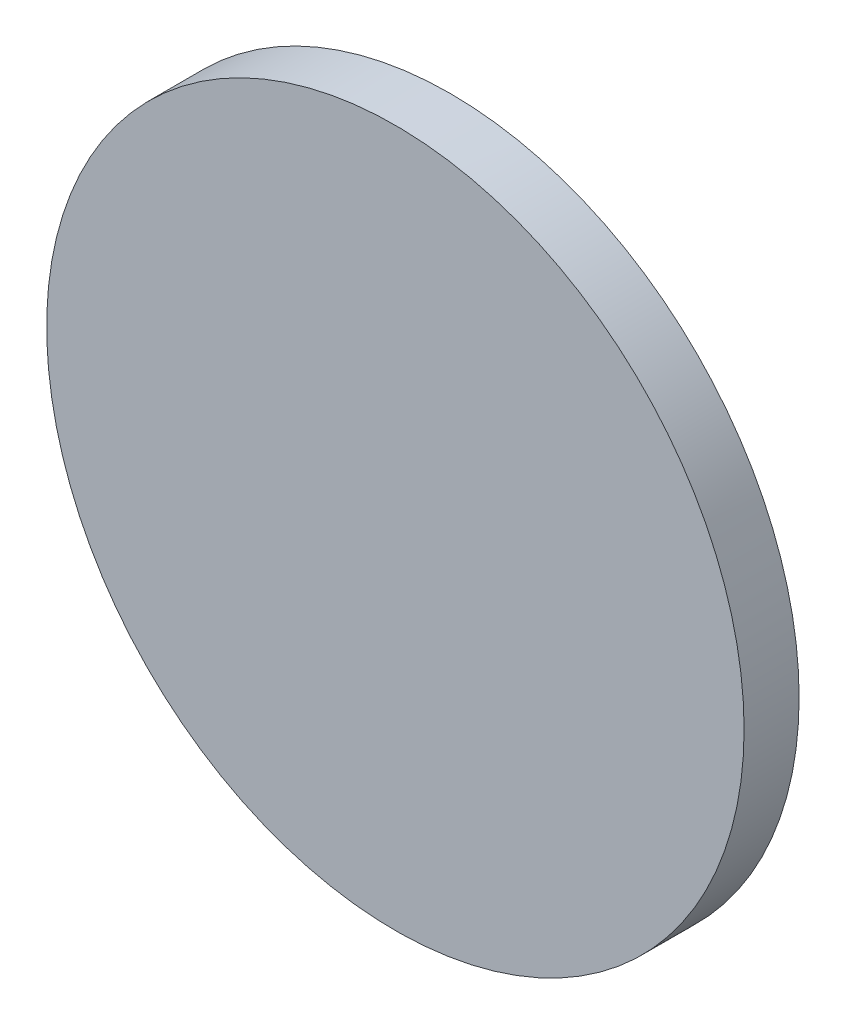
ISO-10303-21;
HEADER;
FILE_DESCRIPTION(('STEP AP214'),'2;1');
FILE_NAME('part.step','',(''),(''),'','','');
FILE_SCHEMA(('AUTOMOTIVE_DESIGN { 1 0 10303 214 1 1 1 1 }'));
ENDSEC;
DATA;
#1=APPLICATION_CONTEXT('core data for automotive mechanical design processes');
#2=APPLICATION_PROTOCOL_DEFINITION('international standard','automotive_design',2000,#1);
#3=PRODUCT_CONTEXT('',#1,'mechanical');
#4=PRODUCT('Part','Part','',(#3));
#5=PRODUCT_RELATED_PRODUCT_CATEGORY('part','',(#4));
#6=PRODUCT_DEFINITION_FORMATION('','',#4);
#7=PRODUCT_DEFINITION_CONTEXT('part definition',#1,'design');
#8=PRODUCT_DEFINITION('design','',#6,#7);
#9=PRODUCT_DEFINITION_SHAPE('','',#8);
#10=(LENGTH_UNIT() NAMED_UNIT(*) SI_UNIT(.MILLI.,.METRE.));
#11=(NAMED_UNIT(*) PLANE_ANGLE_UNIT() SI_UNIT($,.RADIAN.));
#12=(NAMED_UNIT(*) SI_UNIT($,.STERADIAN.) SOLID_ANGLE_UNIT());
#13=UNCERTAINTY_MEASURE_WITH_UNIT(LENGTH_MEASURE(1.E-05),#10,'distance_accuracy_value','');
#14=(GEOMETRIC_REPRESENTATION_CONTEXT(3) GLOBAL_UNCERTAINTY_ASSIGNED_CONTEXT((#13)) GLOBAL_UNIT_ASSIGNED_CONTEXT((#10,
#11,#12)) REPRESENTATION_CONTEXT('',''));
#15=CARTESIAN_POINT('',(0.,0.,0.));
#16=DIRECTION('',(0.,0.,1.));
#17=DIRECTION('',(1.,0.,0.));
#18=AXIS2_PLACEMENT_3D('',#15,#16,#17);
#19=CARTESIAN_POINT('',(0.,26.112,6.16));
#20=DIRECTION('',(0.,0.,1.));
#21=DIRECTION('',(1.,0.,0.));
#22=AXIS2_PLACEMENT_3D('',#19,#20,#21);
#23=PLANE('',#22);
#24=CARTESIAN_POINT('',(0.,0.,6.16));
#25=DIRECTION('',(0.,0.,1.));
#26=DIRECTION('',(1.,0.,0.));
#27=AXIS2_PLACEMENT_3D('',#24,#25,#26);
#28=CIRCLE('',#27,12.7);
#29=CARTESIAN_POINT('',(12.7,0.,6.16));
#30=VERTEX_POINT('',#29);
#31=EDGE_CURVE('E18',#30,#30,#28,.F.);
#32=ORIENTED_EDGE('',*,*,#31,.F.);
#33=EDGE_LOOP('',(#32));
#34=FACE_BOUND('',#33,.T.);
#35=ADVANCED_FACE('F15',(#34),#23,.T.);
#36=CARTESIAN_POINT('',(0.,0.,4.15666201346606));
#37=DIRECTION('',(0.,0.,1.));
#38=DIRECTION('',(1.,0.,0.));
#39=AXIS2_PLACEMENT_3D('',#36,#37,#38);
#40=CYLINDRICAL_SURFACE('',#39,12.7);
#41=ORIENTED_EDGE('',*,*,#31,.T.);
#42=EDGE_LOOP('',(#41));
#43=FACE_BOUND('',#42,.T.);
#44=CARTESIAN_POINT('',(0.,0.,4.15666201346606));
#45=DIRECTION('',(0.,0.,-1.));
#46=DIRECTION('',(-1.,0.,0.));
#47=AXIS2_PLACEMENT_3D('',#44,#45,#46);
#48=CIRCLE('',#47,12.7);
#49=CARTESIAN_POINT('',(-12.7,0.,4.15666201346606));
#50=VERTEX_POINT('',#49);
#51=EDGE_CURVE('E9',#50,#50,#48,.T.);
#52=ORIENTED_EDGE('',*,*,#51,.F.);
#53=EDGE_LOOP('',(#52));
#54=FACE_BOUND('',#53,.T.);
#55=ADVANCED_FACE('F26',(#43,#54),#40,.T.);
#56=CARTESIAN_POINT('',(0.,12.7,4.15666201346606));
#57=CARTESIAN_POINT('',(-12.7,12.7,4.15666201346606));
#58=CARTESIAN_POINT('',(-12.7,0.,4.15666201346606));
#59=CARTESIAN_POINT('',(-12.7,-12.7,4.15666201346606));
#60=CARTESIAN_POINT('',(0.,-12.7,4.15666201346606));
#61=CARTESIAN_POINT('',(12.7,-12.7,4.15666201346606));
#62=CARTESIAN_POINT('',(12.7,0.,4.15666201346606));
#63=CARTESIAN_POINT('',(12.7,12.7,4.15666201346606));
#64=CARTESIAN_POINT('',(0.,12.7,4.15666201346606));
#65=CARTESIAN_POINT('',(0.,12.005884584053,3.7430649875889));
#66=CARTESIAN_POINT('',(-12.005884584053,12.005884584053,3.7430649875889));
#67=CARTESIAN_POINT('',(-12.005884584053,0.,3.7430649875889));
#68=CARTESIAN_POINT('',(-12.005884584053,-12.005884584053,3.7430649875889));
#69=CARTESIAN_POINT('',(0.,-12.005884584053,3.7430649875889));
#70=CARTESIAN_POINT('',(12.005884584053,-12.005884584053,3.7430649875889));
#71=CARTESIAN_POINT('',(12.005884584053,0.,3.7430649875889));
#72=CARTESIAN_POINT('',(12.005884584053,12.005884584053,3.7430649875889));
#73=CARTESIAN_POINT('',(0.,12.005884584053,3.7430649875889));
#74=CARTESIAN_POINT('',(0.,11.129954402447,3.24662021707519));
#75=CARTESIAN_POINT('',(-11.129954402447,11.129954402447,3.24662021707519));
#76=CARTESIAN_POINT('',(-11.129954402447,0.,3.24662021707519));
#77=CARTESIAN_POINT('',(-11.129954402447,-11.129954402447,3.24662021707519));
#78=CARTESIAN_POINT('',(0.,-11.129954402447,3.24662021707519));
#79=CARTESIAN_POINT('',(11.129954402447,-11.1299544024471,3.24662021707519));
#80=CARTESIAN_POINT('',(11.129954402447,0.,3.24662021707519));
#81=CARTESIAN_POINT('',(11.1299544024471,11.129954402447,3.24662021707519));
#82=CARTESIAN_POINT('',(0.,11.129954402447,3.24662021707519));
#83=CARTESIAN_POINT('',(0.,9.88719039333032,2.60418592105462));
#84=CARTESIAN_POINT('',(-9.88719039333032,9.88719039333032,2.60418592105462));
#85=CARTESIAN_POINT('',(-9.88719039333032,0.,2.60418592105462));
#86=CARTESIAN_POINT('',(-9.88719039333033,-9.88719039333032,2.60418592105462));
#87=CARTESIAN_POINT('',(0.,-9.88719039333032,2.60418592105462));
#88=CARTESIAN_POINT('',(9.88719039333032,-9.88719039333033,2.60418592105462));
#89=CARTESIAN_POINT('',(9.88719039333032,0.,2.60418592105462));
#90=CARTESIAN_POINT('',(9.88719039333033,9.88719039333032,2.60418592105462));
#91=CARTESIAN_POINT('',(0.,9.88719039333032,2.60418592105462));
#92=CARTESIAN_POINT('',(0.,9.18206814221909,2.26118562159261));
#93=CARTESIAN_POINT('',(-9.18206814221909,9.18206814221909,2.26118562159261));
#94=CARTESIAN_POINT('',(-9.18206814221909,0.,2.26118562159261));
#95=CARTESIAN_POINT('',(-9.18206814221909,-9.18206814221909,2.26118562159261));
#96=CARTESIAN_POINT('',(0.,-9.18206814221909,2.26118562159261));
#97=CARTESIAN_POINT('',(9.18206814221909,-9.18206814221909,2.26118562159261));
#98=CARTESIAN_POINT('',(9.18206814221909,0.,2.26118562159261));
#99=CARTESIAN_POINT('',(9.18206814221909,9.18206814221909,2.26118562159261));
#100=CARTESIAN_POINT('',(0.,9.18206814221909,2.26118562159261));
#101=CARTESIAN_POINT('',(0.,8.29989859701964,1.86188294041168));
#102=CARTESIAN_POINT('',(-8.29989859701964,8.29989859701964,1.86188294041168));
#103=CARTESIAN_POINT('',(-8.29989859701964,0.,1.86188294041168));
#104=CARTESIAN_POINT('',(-8.29989859701964,-8.29989859701964,1.86188294041168));
#105=CARTESIAN_POINT('',(0.,-8.29989859701964,1.86188294041168));
#106=CARTESIAN_POINT('',(8.29989859701964,-8.29989859701964,1.86188294041168));
#107=CARTESIAN_POINT('',(8.29989859701964,0.,1.86188294041168));
#108=CARTESIAN_POINT('',(8.29989859701964,8.29989859701964,1.86188294041168));
#109=CARTESIAN_POINT('',(0.,8.29989859701964,1.86188294041168));
#110=CARTESIAN_POINT('',(0.,7.59456909210475,1.56695193799394));
#111=CARTESIAN_POINT('',(-7.59456909210474,7.59456909210475,1.56695193799394));
#112=CARTESIAN_POINT('',(-7.59456909210475,0.,1.56695193799394));
#113=CARTESIAN_POINT('',(-7.59456909210475,-7.59456909210474,1.56695193799394));
#114=CARTESIAN_POINT('',(0.,-7.59456909210475,1.56695193799394));
#115=CARTESIAN_POINT('',(7.59456909210474,-7.59456909210475,1.56695193799394));
#116=CARTESIAN_POINT('',(7.59456909210475,0.,1.56695193799394));
#117=CARTESIAN_POINT('',(7.59456909210475,7.59456909210474,1.56695193799394));
#118=CARTESIAN_POINT('',(0.,7.59456909210475,1.56695193799394));
#119=CARTESIAN_POINT('',(0.,6.71189133384402,1.23088275873303));
#120=CARTESIAN_POINT('',(-6.71189133384402,6.71189133384402,1.23088275873303));
#121=CARTESIAN_POINT('',(-6.71189133384402,0.,1.23088275873303));
#122=CARTESIAN_POINT('',(-6.71189133384402,-6.71189133384402,1.23088275873303));
#123=CARTESIAN_POINT('',(0.,-6.71189133384402,1.23088275873303));
#124=CARTESIAN_POINT('',(6.71189133384402,-6.71189133384402,1.23088275873303));
#125=CARTESIAN_POINT('',(6.71189133384402,0.,1.23088275873303));
#126=CARTESIAN_POINT('',(6.71189133384402,6.71189133384402,1.23088275873303));
#127=CARTESIAN_POINT('',(0.,6.71189133384402,1.23088275873303));
#128=CARTESIAN_POINT('',(0.,6.00632821082988,0.988938813868019));
#129=CARTESIAN_POINT('',(-6.00632821082988,6.00632821082988,0.988938813868019));
#130=CARTESIAN_POINT('',(-6.00632821082988,0.,0.988938813868019));
#131=CARTESIAN_POINT('',(-6.00632821082988,-6.00632821082988,0.988938813868019));
#132=CARTESIAN_POINT('',(0.,-6.00632821082988,0.988938813868019));
#133=CARTESIAN_POINT('',(6.00632821082988,-6.00632821082988,0.988938813868019));
#134=CARTESIAN_POINT('',(6.00632821082988,0.,0.988938813868019));
#135=CARTESIAN_POINT('',(6.00632821082988,6.00632821082987,0.988938813868019));
#136=CARTESIAN_POINT('',(0.,6.00632821082988,0.988938813868019));
#137=CARTESIAN_POINT('',(0.,5.12312813308506,0.721672320795702));
#138=CARTESIAN_POINT('',(-5.12312813308506,5.12312813308506,0.721672320795702));
#139=CARTESIAN_POINT('',(-5.12312813308506,0.,0.721672320795702));
#140=CARTESIAN_POINT('',(-5.12312813308506,-5.12312813308506,0.721672320795702));
#141=CARTESIAN_POINT('',(0.,-5.12312813308506,0.721672320795702));
#142=CARTESIAN_POINT('',(5.12312813308506,-5.12312813308506,0.721672320795702));
#143=CARTESIAN_POINT('',(5.12312813308506,0.,0.721672320795702));
#144=CARTESIAN_POINT('',(5.12312813308506,5.12312813308506,0.721672320795702));
#145=CARTESIAN_POINT('',(0.,5.12312813308506,0.721672320795702));
#146=CARTESIAN_POINT('',(0.,4.41732453759341,0.53668607968357));
#147=CARTESIAN_POINT('',(-4.41732453759341,4.41732453759341,0.53668607968357));
#148=CARTESIAN_POINT('',(-4.41732453759341,0.,0.53668607968357));
#149=CARTESIAN_POINT('',(-4.41732453759341,-4.41732453759341,0.53668607968357));
#150=CARTESIAN_POINT('',(0.,-4.41732453759341,0.53668607968357));
#151=CARTESIAN_POINT('',(4.41732453759341,-4.41732453759341,0.53668607968357));
#152=CARTESIAN_POINT('',(4.41732453759341,0.,0.53668607968357));
#153=CARTESIAN_POINT('',(4.41732453759341,4.41732453759341,0.53668607968357));
#154=CARTESIAN_POINT('',(0.,4.41732453759341,0.53668607968357));
#155=CARTESIAN_POINT('',(0.,3.53364302935066,0.34260285267664));
#156=CARTESIAN_POINT('',(-3.53364302935066,3.53364302935066,0.34260285267664));
#157=CARTESIAN_POINT('',(-3.53364302935066,0.,0.34260285267664));
#158=CARTESIAN_POINT('',(-3.53364302935066,-3.53364302935066,0.34260285267664));
#159=CARTESIAN_POINT('',(0.,-3.53364302935066,0.34260285267664));
#160=CARTESIAN_POINT('',(3.53364302935066,-3.53364302935066,0.34260285267664));
#161=CARTESIAN_POINT('',(3.53364302935066,0.,0.34260285267664));
#162=CARTESIAN_POINT('',(3.53364302935066,3.53364302935066,0.34260285267664));
#163=CARTESIAN_POINT('',(0.,3.53364302935066,0.34260285267664));
#164=CARTESIAN_POINT('',(0.,2.82761595440822,0.217584855024545));
#165=CARTESIAN_POINT('',(-2.82761595440822,2.82761595440822,0.217584855024545));
#166=CARTESIAN_POINT('',(-2.82761595440822,0.,0.217584855024545));
#167=CARTESIAN_POINT('',(-2.82761595440822,-2.82761595440822,0.217584855024545));
#168=CARTESIAN_POINT('',(0.,-2.82761595440822,0.217584855024545));
#169=CARTESIAN_POINT('',(2.82761595440822,-2.82761595440822,0.217584855024545));
#170=CARTESIAN_POINT('',(2.82761595440822,0.,0.217584855024545));
#171=CARTESIAN_POINT('',(2.82761595440822,2.82761595440822,0.217584855024545));
#172=CARTESIAN_POINT('',(0.,2.82761595440822,0.217584855024545));
#173=CARTESIAN_POINT('',(0.,1.85600189097516,0.0881876691316651));
#174=CARTESIAN_POINT('',(-1.85600189097516,1.85600189097516,0.0881876691316651));
#175=CARTESIAN_POINT('',(-1.85600189097516,0.,0.0881876691316651));
#176=CARTESIAN_POINT('',(-1.85600189097516,-1.85600189097516,0.0881876691316651));
#177=CARTESIAN_POINT('',(0.,-1.85600189097516,0.0881876691316651));
#178=CARTESIAN_POINT('',(1.85600189097516,-1.85600189097516,0.0881876691316651));
#179=CARTESIAN_POINT('',(1.85600189097516,0.,0.0881876691316651));
#180=CARTESIAN_POINT('',(1.85600189097516,1.85600189097516,0.0881876691316651));
#181=CARTESIAN_POINT('',(0.,1.85600189097516,0.0881876691316651));
#182=CARTESIAN_POINT('',(0.,0.973260255066641,0.0158229715697026));
#183=CARTESIAN_POINT('',(-0.973260255066641,0.973260255066641,0.0158229715697026));
#184=CARTESIAN_POINT('',(-0.973260255066641,0.,0.0158229715697026));
#185=CARTESIAN_POINT('',(-0.973260255066641,-0.973260255066641,0.0158229715697026));
#186=CARTESIAN_POINT('',(0.,-0.973260255066641,0.0158229715697026));
#187=CARTESIAN_POINT('',(0.973260255066641,-0.973260255066641,0.0158229715697026));
#188=CARTESIAN_POINT('',(0.973260255066641,0.,0.0158229715697026));
#189=CARTESIAN_POINT('',(0.973260255066641,0.973260255066641,0.0158229715697026));
#190=CARTESIAN_POINT('',(0.,0.973260255066641,0.0158229715697026));
#191=CARTESIAN_POINT('',(0.,0.264845472297847,0.));
#192=CARTESIAN_POINT('',(-0.264845472297847,0.264845472297847,0.));
#193=CARTESIAN_POINT('',(-0.264845472297847,0.,0.));
#194=CARTESIAN_POINT('',(-0.264845472297847,-0.264845472297847,0.));
#195=CARTESIAN_POINT('',(0.,-0.264845472297847,0.));
#196=CARTESIAN_POINT('',(0.264845472297847,-0.264845472297847,0.));
#197=CARTESIAN_POINT('',(0.264845472297847,0.,0.));
#198=CARTESIAN_POINT('',(0.264845472297847,0.264845472297847,0.));
#199=CARTESIAN_POINT('',(0.,0.264845472297847,0.));
#200=CARTESIAN_POINT('',(0.,0.,0.));
#201=CARTESIAN_POINT('',(0.,0.,0.));
#202=CARTESIAN_POINT('',(0.,0.,0.));
#203=CARTESIAN_POINT('',(0.,0.,0.));
#204=CARTESIAN_POINT('',(0.,0.,0.));
#205=CARTESIAN_POINT('',(0.,0.,0.));
#206=CARTESIAN_POINT('',(0.,0.,0.));
#207=CARTESIAN_POINT('',(0.,0.,0.));
#208=CARTESIAN_POINT('',(0.,0.,0.));
#209=(BOUNDED_SURFACE() B_SPLINE_SURFACE(3,2,((#56,#57,#58,#59,#60,#61,#62,#63,#64),(#65,#66,
#67,#68,#69,#70,#71,#72,#73),(#74,#75,#76,#77,#78,#79,#80,#81,#82),(#83,#84,#85,#86,#87,#88,#89,
#90,#91),(#92,#93,#94,#95,#96,#97,#98,#99,#100),(#101,#102,#103,#104,#105,#106,#107,#108,#109),
(#110,#111,#112,#113,#114,#115,#116,#117,#118),(#119,#120,#121,#122,#123,#124,#125,#126,#127),
(#128,#129,#130,#131,#132,#133,#134,#135,#136),(#137,#138,#139,#140,#141,#142,#143,#144,#145),
(#146,#147,#148,#149,#150,#151,#152,#153,#154),(#155,#156,#157,#158,#159,#160,#161,#162,#163),
(#164,#165,#166,#167,#168,#169,#170,#171,#172),(#173,#174,#175,#176,#177,#178,#179,#180,#181),
(#182,#183,#184,#185,#186,#187,#188,#189,#190),(#191,#192,#193,#194,#195,#196,#197,#198,#199),
(#200,#201,#202,#203,#204,#205,#206,#207,#208)),.UNSPECIFIED.,.F.,.T.,
.F.) B_SPLINE_SURFACE_WITH_KNOTS((4,1,1,1,1,1,1,1,1,1,1,1,1,1,4),(3,2,2,2,3),(0.,
0.179164099213288,0.22317989396883,0.310116552248439,0.353037415772505,0.437800348076605,
0.479642416856639,0.562341875057897,0.603199264479122,0.684097385631499,0.72413811736265,
0.803634915319735,0.843090981545668,0.9412735238858,1.),(0.,90.,180.,270.,360.),
.UNSPECIFIED.) GEOMETRIC_REPRESENTATION_ITEM() RATIONAL_B_SPLINE_SURFACE(((1.,0.707106781186548,
1.,0.707106781186548,1.,0.707106781186548,1.,0.707106781186548,1.),(1.,0.707106781186548,1.,
0.707106781186548,1.,0.707106781186548,1.,0.707106781186548,1.),(1.,0.707106781186548,1.,
0.707106781186548,1.,0.707106781186548,1.,0.707106781186548,1.),(1.,0.707106781186548,1.,
0.707106781186548,1.,0.707106781186548,1.,0.707106781186548,1.),(1.,0.707106781186548,1.,
0.707106781186548,1.,0.707106781186548,1.,0.707106781186548,1.),(1.,0.707106781186548,1.,
0.707106781186548,1.,0.707106781186548,1.,0.707106781186548,1.),(1.,0.707106781186548,1.,
0.707106781186548,1.,0.707106781186548,1.,0.707106781186548,1.),(1.,0.707106781186548,1.,
0.707106781186548,1.,0.707106781186548,1.,0.707106781186548,1.),(1.,0.707106781186548,1.,
0.707106781186548,1.,0.707106781186548,1.,0.707106781186548,1.),(1.,0.707106781186548,1.,
0.707106781186548,1.,0.707106781186548,1.,0.707106781186548,1.),(1.,0.707106781186548,1.,
0.707106781186548,1.,0.707106781186548,1.,0.707106781186548,1.),(1.,0.707106781186548,1.,
0.707106781186548,1.,0.707106781186548,1.,0.707106781186548,1.),(1.,0.707106781186548,1.,
0.707106781186548,1.,0.707106781186548,1.,0.707106781186548,1.),(1.,0.707106781186548,1.,
0.707106781186548,1.,0.707106781186548,1.,0.707106781186548,1.),(1.,0.707106781186548,1.,
0.707106781186548,1.,0.707106781186548,1.,0.707106781186548,1.),(1.,0.707106781186548,1.,
0.707106781186548,1.,0.707106781186548,1.,0.707106781186548,1.),(1.,0.707106781186548,1.,
0.707106781186548,1.,0.707106781186548,1.,0.707106781186548,1.))) REPRESENTATION_ITEM('') SURFACE());
#210=ORIENTED_EDGE('',*,*,#51,.T.);
#211=EDGE_LOOP('',(#210));
#212=FACE_BOUND('',#211,.T.);
#213=CARTESIAN_POINT('',(0.,0.,0.));
#214=VERTEX_POINT('',#213);
#215=VERTEX_LOOP('',#214);
#216=FACE_BOUND('',#215,.T.);
#217=ADVANCED_FACE('F24',(#212,#216),#209,.T.);
#218=CLOSED_SHELL('',(#35,#55,#217));
#219=MANIFOLD_SOLID_BREP('B1',#218);
#220=ADVANCED_BREP_SHAPE_REPRESENTATION('',(#18,#219),#14);
#221=SHAPE_DEFINITION_REPRESENTATION(#9,#220);
ENDSEC;
END-ISO-10303-21;
